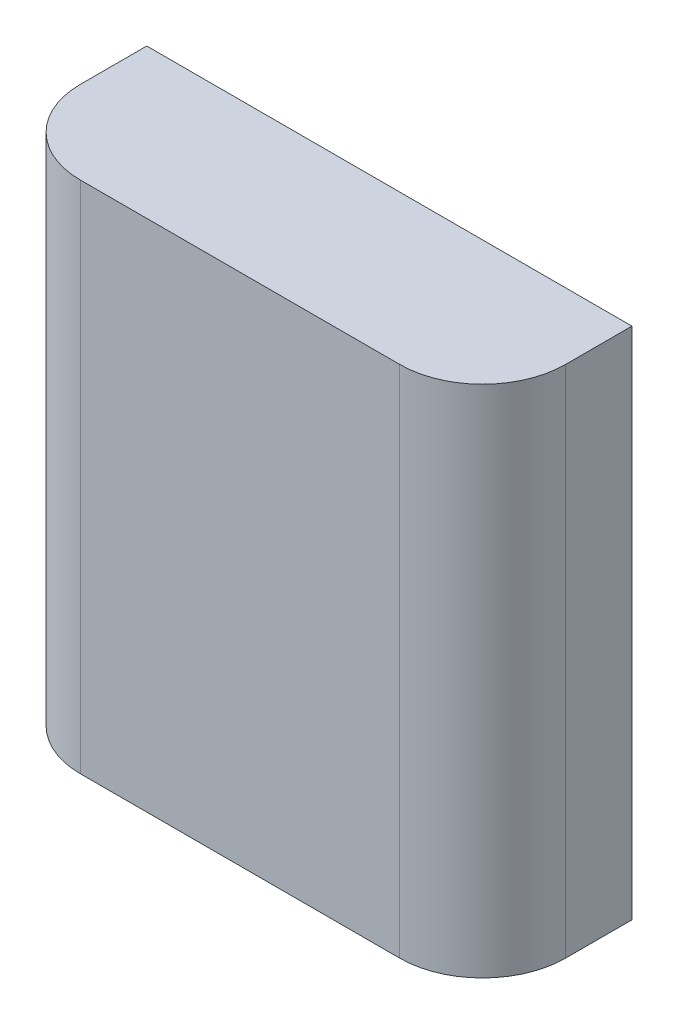
ISO-10303-21;
HEADER;
FILE_DESCRIPTION(('STEP AP214'),'2;1');
FILE_NAME('part.step','',(''),(''),'','','');
FILE_SCHEMA(('AUTOMOTIVE_DESIGN { 1 0 10303 214 1 1 1 1 }'));
ENDSEC;
DATA;
#1=APPLICATION_CONTEXT('core data for automotive mechanical design processes');
#2=APPLICATION_PROTOCOL_DEFINITION('international standard','automotive_design',2000,#1);
#3=PRODUCT_CONTEXT('',#1,'mechanical');
#4=PRODUCT('Part','Part','',(#3));
#5=PRODUCT_RELATED_PRODUCT_CATEGORY('part','',(#4));
#6=PRODUCT_DEFINITION_FORMATION('','',#4);
#7=PRODUCT_DEFINITION_CONTEXT('part definition',#1,'design');
#8=PRODUCT_DEFINITION('design','',#6,#7);
#9=PRODUCT_DEFINITION_SHAPE('','',#8);
#10=(LENGTH_UNIT() NAMED_UNIT(*) SI_UNIT(.MILLI.,.METRE.));
#11=(NAMED_UNIT(*) PLANE_ANGLE_UNIT() SI_UNIT($,.RADIAN.));
#12=(NAMED_UNIT(*) SI_UNIT($,.STERADIAN.) SOLID_ANGLE_UNIT());
#13=UNCERTAINTY_MEASURE_WITH_UNIT(LENGTH_MEASURE(1.E-05),#10,'distance_accuracy_value','');
#14=(GEOMETRIC_REPRESENTATION_CONTEXT(3) GLOBAL_UNCERTAINTY_ASSIGNED_CONTEXT((#13)) GLOBAL_UNIT_ASSIGNED_CONTEXT((#10,
#11,#12)) REPRESENTATION_CONTEXT('',''));
#15=CARTESIAN_POINT('',(0.,0.,0.));
#16=DIRECTION('',(0.,0.,1.));
#17=DIRECTION('',(1.,0.,0.));
#18=AXIS2_PLACEMENT_3D('',#15,#16,#17);
#19=CARTESIAN_POINT('',(29.25,-31.,18.));
#20=DIRECTION('',(-1.,0.,0.));
#21=DIRECTION('',(0.,0.,1.));
#22=AXIS2_PLACEMENT_3D('',#19,#20,#21);
#23=PLANE('',#22);
#24=DIRECTION('',(0.,0.,-1.));
#25=VECTOR('',#24,1.);
#26=CARTESIAN_POINT('',(29.25,31.,18.));
#27=LINE('',#26,#25);
#28=CARTESIAN_POINT('',(29.25,31.,8.));
#29=VERTEX_POINT('',#28);
#30=CARTESIAN_POINT('',(29.25,31.,0.));
#31=VERTEX_POINT('',#30);
#32=EDGE_CURVE('E84',#29,#31,#27,.T.);
#33=ORIENTED_EDGE('',*,*,#32,.F.);
#34=DIRECTION('',(0.,1.,0.));
#35=VECTOR('',#34,1.);
#36=CARTESIAN_POINT('',(29.25,-31.,8.));
#37=LINE('',#36,#35);
#38=CARTESIAN_POINT('',(29.25,-31.,8.));
#39=VERTEX_POINT('',#38);
#40=EDGE_CURVE('E11',#29,#39,#37,.F.);
#41=ORIENTED_EDGE('',*,*,#40,.T.);
#42=DIRECTION('',(0.,0.,-1.));
#43=VECTOR('',#42,1.);
#44=CARTESIAN_POINT('',(29.25,-31.,18.));
#45=LINE('',#44,#43);
#46=CARTESIAN_POINT('',(29.25,-31.,0.));
#47=VERTEX_POINT('',#46);
#48=EDGE_CURVE('E104',#39,#47,#45,.T.);
#49=ORIENTED_EDGE('',*,*,#48,.T.);
#50=DIRECTION('',(0.,1.,0.));
#51=VECTOR('',#50,1.);
#52=CARTESIAN_POINT('',(29.25,-31.,0.));
#53=LINE('',#52,#51);
#54=EDGE_CURVE('E99',#47,#31,#53,.T.);
#55=ORIENTED_EDGE('',*,*,#54,.T.);
#56=EDGE_LOOP('',(#33,#41,#49,#55));
#57=FACE_BOUND('',#56,.T.);
#58=ADVANCED_FACE('F33',(#57),#23,.F.);
#59=CARTESIAN_POINT('',(-29.25,31.,18.));
#60=DIRECTION('',(0.,-1.,0.));
#61=DIRECTION('',(0.,0.,-1.));
#62=AXIS2_PLACEMENT_3D('',#59,#60,#61);
#63=PLANE('',#62);
#64=DIRECTION('',(0.,0.,-1.));
#65=VECTOR('',#64,1.);
#66=CARTESIAN_POINT('',(-29.25,31.,18.));
#67=LINE('',#66,#65);
#68=CARTESIAN_POINT('',(-29.25,31.,8.));
#69=VERTEX_POINT('',#68);
#70=CARTESIAN_POINT('',(-29.25,31.,0.));
#71=VERTEX_POINT('',#70);
#72=EDGE_CURVE('E93',#69,#71,#67,.T.);
#73=ORIENTED_EDGE('',*,*,#72,.F.);
#74=CARTESIAN_POINT('',(-19.25,31.,8.));
#75=DIRECTION('',(0.,-1.,0.));
#76=DIRECTION('',(0.,0.,-1.));
#77=AXIS2_PLACEMENT_3D('',#74,#75,#76);
#78=CIRCLE('',#77,10.);
#79=CARTESIAN_POINT('',(-19.25,31.,18.));
#80=VERTEX_POINT('',#79);
#81=EDGE_CURVE('E41',#69,#80,#78,.F.);
#82=ORIENTED_EDGE('',*,*,#81,.T.);
#83=DIRECTION('',(-1.,0.,0.));
#84=VECTOR('',#83,1.);
#85=CARTESIAN_POINT('',(-29.25,31.,18.));
#86=LINE('',#85,#84);
#87=CARTESIAN_POINT('',(19.25,31.,18.));
#88=VERTEX_POINT('',#87);
#89=EDGE_CURVE('E114',#88,#80,#86,.T.);
#90=ORIENTED_EDGE('',*,*,#89,.F.);
#91=CARTESIAN_POINT('',(19.25,31.,8.));
#92=DIRECTION('',(0.,-1.,0.));
#93=DIRECTION('',(0.,0.,-1.));
#94=AXIS2_PLACEMENT_3D('',#91,#92,#93);
#95=CIRCLE('',#94,10.);
#96=EDGE_CURVE('E48',#88,#29,#95,.F.);
#97=ORIENTED_EDGE('',*,*,#96,.T.);
#98=ORIENTED_EDGE('',*,*,#32,.T.);
#99=DIRECTION('',(-1.,0.,0.));
#100=VECTOR('',#99,1.);
#101=CARTESIAN_POINT('',(-29.25,31.,0.));
#102=LINE('',#101,#100);
#103=EDGE_CURVE('E87',#31,#71,#102,.T.);
#104=ORIENTED_EDGE('',*,*,#103,.T.);
#105=EDGE_LOOP('',(#73,#82,#90,#97,#98,#104));
#106=FACE_BOUND('',#105,.T.);
#107=ADVANCED_FACE('F86',(#106),#63,.F.);
#108=CARTESIAN_POINT('',(-29.25,-31.,18.));
#109=DIRECTION('',(1.,0.,0.));
#110=DIRECTION('',(0.,0.,-1.));
#111=AXIS2_PLACEMENT_3D('',#108,#109,#110);
#112=PLANE('',#111);
#113=DIRECTION('',(0.,0.,-1.));
#114=VECTOR('',#113,1.);
#115=CARTESIAN_POINT('',(-29.25,-31.,18.));
#116=LINE('',#115,#114);
#117=CARTESIAN_POINT('',(-29.25,-31.,8.));
#118=VERTEX_POINT('',#117);
#119=CARTESIAN_POINT('',(-29.25,-31.,0.));
#120=VERTEX_POINT('',#119);
#121=EDGE_CURVE('E116',#118,#120,#116,.T.);
#122=ORIENTED_EDGE('',*,*,#121,.F.);
#123=DIRECTION('',(0.,-1.,0.));
#124=VECTOR('',#123,1.);
#125=CARTESIAN_POINT('',(-29.25,-31.,8.));
#126=LINE('',#125,#124);
#127=EDGE_CURVE('E56',#118,#69,#126,.F.);
#128=ORIENTED_EDGE('',*,*,#127,.T.);
#129=ORIENTED_EDGE('',*,*,#72,.T.);
#130=DIRECTION('',(0.,-1.,0.));
#131=VECTOR('',#130,1.);
#132=CARTESIAN_POINT('',(-29.25,-31.,0.));
#133=LINE('',#132,#131);
#134=EDGE_CURVE('E101',#71,#120,#133,.T.);
#135=ORIENTED_EDGE('',*,*,#134,.T.);
#136=EDGE_LOOP('',(#122,#128,#129,#135));
#137=FACE_BOUND('',#136,.T.);
#138=ADVANCED_FACE('F141',(#137),#112,.F.);
#139=CARTESIAN_POINT('',(-29.25,-31.,18.));
#140=DIRECTION('',(0.,1.,0.));
#141=DIRECTION('',(0.,0.,1.));
#142=AXIS2_PLACEMENT_3D('',#139,#140,#141);
#143=PLANE('',#142);
#144=DIRECTION('',(1.,0.,0.));
#145=VECTOR('',#144,1.);
#146=CARTESIAN_POINT('',(-29.25,-31.,18.));
#147=LINE('',#146,#145);
#148=CARTESIAN_POINT('',(-19.25,-31.,18.));
#149=VERTEX_POINT('',#148);
#150=CARTESIAN_POINT('',(19.25,-31.,18.));
#151=VERTEX_POINT('',#150);
#152=EDGE_CURVE('E108',#149,#151,#147,.T.);
#153=ORIENTED_EDGE('',*,*,#152,.F.);
#154=CARTESIAN_POINT('',(-19.25,-31.,8.));
#155=DIRECTION('',(0.,1.,0.));
#156=DIRECTION('',(0.,0.,1.));
#157=AXIS2_PLACEMENT_3D('',#154,#155,#156);
#158=CIRCLE('',#157,10.);
#159=EDGE_CURVE('E126',#149,#118,#158,.F.);
#160=ORIENTED_EDGE('',*,*,#159,.T.);
#161=ORIENTED_EDGE('',*,*,#121,.T.);
#162=DIRECTION('',(1.,0.,0.));
#163=VECTOR('',#162,1.);
#164=CARTESIAN_POINT('',(-29.25,-31.,0.));
#165=LINE('',#164,#163);
#166=EDGE_CURVE('E112',#120,#47,#165,.T.);
#167=ORIENTED_EDGE('',*,*,#166,.T.);
#168=ORIENTED_EDGE('',*,*,#48,.F.);
#169=CARTESIAN_POINT('',(19.25,-31.,8.));
#170=DIRECTION('',(0.,1.,0.));
#171=DIRECTION('',(0.,0.,1.));
#172=AXIS2_PLACEMENT_3D('',#169,#170,#171);
#173=CIRCLE('',#172,10.);
#174=EDGE_CURVE('E124',#39,#151,#173,.F.);
#175=ORIENTED_EDGE('',*,*,#174,.T.);
#176=EDGE_LOOP('',(#153,#160,#161,#167,#168,#175));
#177=FACE_BOUND('',#176,.T.);
#178=ADVANCED_FACE('F140',(#177),#143,.F.);
#179=CARTESIAN_POINT('',(29.25,31.,18.));
#180=DIRECTION('',(0.,0.,-1.));
#181=DIRECTION('',(-1.,0.,0.));
#182=AXIS2_PLACEMENT_3D('',#179,#180,#181);
#183=PLANE('',#182);
#184=ORIENTED_EDGE('',*,*,#89,.T.);
#185=DIRECTION('',(0.,-1.,0.));
#186=VECTOR('',#185,1.);
#187=CARTESIAN_POINT('',(-19.25,31.,18.));
#188=LINE('',#187,#186);
#189=EDGE_CURVE('E121',#80,#149,#188,.T.);
#190=ORIENTED_EDGE('',*,*,#189,.T.);
#191=ORIENTED_EDGE('',*,*,#152,.T.);
#192=DIRECTION('',(0.,1.,0.));
#193=VECTOR('',#192,1.);
#194=CARTESIAN_POINT('',(19.25,31.,18.));
#195=LINE('',#194,#193);
#196=EDGE_CURVE('E92',#151,#88,#195,.T.);
#197=ORIENTED_EDGE('',*,*,#196,.T.);
#198=EDGE_LOOP('',(#184,#190,#191,#197));
#199=FACE_BOUND('',#198,.T.);
#200=ADVANCED_FACE('F134',(#199),#183,.F.);
#201=CARTESIAN_POINT('',(29.25,31.,0.));
#202=DIRECTION('',(0.,0.,-1.));
#203=DIRECTION('',(-1.,0.,0.));
#204=AXIS2_PLACEMENT_3D('',#201,#202,#203);
#205=PLANE('',#204);
#206=ORIENTED_EDGE('',*,*,#54,.F.);
#207=ORIENTED_EDGE('',*,*,#166,.F.);
#208=ORIENTED_EDGE('',*,*,#134,.F.);
#209=ORIENTED_EDGE('',*,*,#103,.F.);
#210=EDGE_LOOP('',(#206,#207,#208,#209));
#211=FACE_BOUND('',#210,.T.);
#212=ADVANCED_FACE('F97',(#211),#205,.T.);
#213=CARTESIAN_POINT('',(-19.25,31.,8.));
#214=DIRECTION('',(0.,-1.,0.));
#215=DIRECTION('',(0.,0.,-1.));
#216=AXIS2_PLACEMENT_3D('',#213,#214,#215);
#217=CYLINDRICAL_SURFACE('',#216,10.);
#218=ORIENTED_EDGE('',*,*,#81,.F.);
#219=ORIENTED_EDGE('',*,*,#127,.F.);
#220=ORIENTED_EDGE('',*,*,#159,.F.);
#221=ORIENTED_EDGE('',*,*,#189,.F.);
#222=EDGE_LOOP('',(#218,#219,#220,#221));
#223=FACE_BOUND('',#222,.T.);
#224=ADVANCED_FACE('F138',(#223),#217,.T.);
#225=CARTESIAN_POINT('',(19.25,31.,8.));
#226=DIRECTION('',(0.,1.,0.));
#227=DIRECTION('',(0.,0.,1.));
#228=AXIS2_PLACEMENT_3D('',#225,#226,#227);
#229=CYLINDRICAL_SURFACE('',#228,10.);
#230=ORIENTED_EDGE('',*,*,#174,.F.);
#231=ORIENTED_EDGE('',*,*,#40,.F.);
#232=ORIENTED_EDGE('',*,*,#96,.F.);
#233=ORIENTED_EDGE('',*,*,#196,.F.);
#234=EDGE_LOOP('',(#230,#231,#232,#233));
#235=FACE_BOUND('',#234,.T.);
#236=ADVANCED_FACE('F35',(#235),#229,.T.);
#237=CLOSED_SHELL('',(#58,#107,#138,#178,#200,#212,#224,#236));
#238=MANIFOLD_SOLID_BREP('B2',#237);
#239=ADVANCED_BREP_SHAPE_REPRESENTATION('',(#18,#238),#14);
#240=SHAPE_DEFINITION_REPRESENTATION(#9,#239);
ENDSEC;
END-ISO-10303-21;
